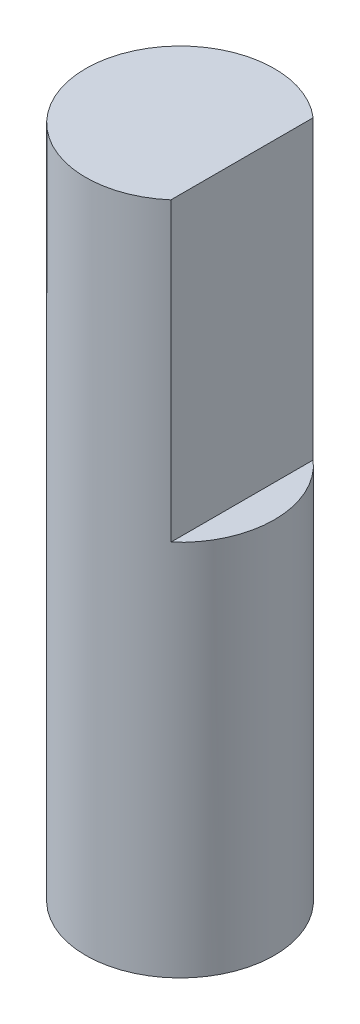
ISO-10303-21;
HEADER;
FILE_DESCRIPTION(('STEP AP214'),'2;1');
FILE_NAME('part.step','',(''),(''),'','','');
FILE_SCHEMA(('AUTOMOTIVE_DESIGN { 1 0 10303 214 1 1 1 1 }'));
ENDSEC;
DATA;
#1=APPLICATION_CONTEXT('core data for automotive mechanical design processes');
#2=APPLICATION_PROTOCOL_DEFINITION('international standard','automotive_design',2000,#1);
#3=PRODUCT_CONTEXT('',#1,'mechanical');
#4=PRODUCT('Part','Part','',(#3));
#5=PRODUCT_RELATED_PRODUCT_CATEGORY('part','',(#4));
#6=PRODUCT_DEFINITION_FORMATION('','',#4);
#7=PRODUCT_DEFINITION_CONTEXT('part definition',#1,'design');
#8=PRODUCT_DEFINITION('design','',#6,#7);
#9=PRODUCT_DEFINITION_SHAPE('','',#8);
#10=(LENGTH_UNIT() NAMED_UNIT(*) SI_UNIT(.MILLI.,.METRE.));
#11=(NAMED_UNIT(*) PLANE_ANGLE_UNIT() SI_UNIT($,.RADIAN.));
#12=(NAMED_UNIT(*) SI_UNIT($,.STERADIAN.) SOLID_ANGLE_UNIT());
#13=UNCERTAINTY_MEASURE_WITH_UNIT(LENGTH_MEASURE(1.E-05),#10,'distance_accuracy_value','');
#14=(GEOMETRIC_REPRESENTATION_CONTEXT(3) GLOBAL_UNCERTAINTY_ASSIGNED_CONTEXT((#13)) GLOBAL_UNIT_ASSIGNED_CONTEXT((#10,
#11,#12)) REPRESENTATION_CONTEXT('',''));
#15=CARTESIAN_POINT('',(0.,0.,0.));
#16=DIRECTION('',(0.,0.,1.));
#17=DIRECTION('',(1.,0.,0.));
#18=AXIS2_PLACEMENT_3D('',#15,#16,#17);
#19=CARTESIAN_POINT('',(0.,25.,0.));
#20=DIRECTION('',(0.,-1.,0.));
#21=DIRECTION('',(0.,0.,-1.));
#22=AXIS2_PLACEMENT_3D('',#19,#20,#21);
#23=CYLINDRICAL_SURFACE('',#22,3.5);
#24=CARTESIAN_POINT('',(0.,25.,0.));
#25=DIRECTION('',(0.,1.,0.));
#26=DIRECTION('',(0.,0.,1.));
#27=AXIS2_PLACEMENT_3D('',#24,#25,#26);
#28=CIRCLE('',#27,3.5);
#29=CARTESIAN_POINT('',(2.3,25.,-2.63818119165458));
#30=VERTEX_POINT('',#29);
#31=CARTESIAN_POINT('',(2.3,25.,2.63818119165458));
#32=VERTEX_POINT('',#31);
#33=EDGE_CURVE('E66',#30,#32,#28,.T.);
#34=ORIENTED_EDGE('',*,*,#33,.F.);
#35=DIRECTION('',(0.,-1.,0.));
#36=VECTOR('',#35,1.);
#37=CARTESIAN_POINT('',(2.3,25.,-2.63818119165458));
#38=LINE('',#37,#36);
#39=CARTESIAN_POINT('',(2.3,14.,-2.63818119165458));
#40=VERTEX_POINT('',#39);
#41=EDGE_CURVE('E50',#30,#40,#38,.T.);
#42=ORIENTED_EDGE('',*,*,#41,.T.);
#43=CARTESIAN_POINT('',(0.,14.,0.));
#44=DIRECTION('',(0.,-1.,0.));
#45=DIRECTION('',(0.,0.,-1.));
#46=AXIS2_PLACEMENT_3D('',#43,#44,#45);
#47=CIRCLE('',#46,3.5);
#48=CARTESIAN_POINT('',(2.3,14.,2.63818119165458));
#49=VERTEX_POINT('',#48);
#50=EDGE_CURVE('E11',#40,#49,#47,.T.);
#51=ORIENTED_EDGE('',*,*,#50,.T.);
#52=DIRECTION('',(0.,-1.,0.));
#53=VECTOR('',#52,1.);
#54=CARTESIAN_POINT('',(2.3,25.,2.63818119165458));
#55=LINE('',#54,#53);
#56=EDGE_CURVE('E62',#49,#32,#55,.F.);
#57=ORIENTED_EDGE('',*,*,#56,.T.);
#58=EDGE_LOOP('',(#34,#42,#51,#57));
#59=FACE_BOUND('',#58,.T.);
#60=CARTESIAN_POINT('',(0.,0.,0.));
#61=DIRECTION('',(0.,1.,0.));
#62=DIRECTION('',(0.,0.,1.));
#63=AXIS2_PLACEMENT_3D('',#60,#61,#62);
#64=CIRCLE('',#63,3.5);
#65=CARTESIAN_POINT('',(0.,0.,3.5));
#66=VERTEX_POINT('',#65);
#67=EDGE_CURVE('E72',#66,#66,#64,.T.);
#68=ORIENTED_EDGE('',*,*,#67,.T.);
#69=EDGE_LOOP('',(#68));
#70=FACE_BOUND('',#69,.T.);
#71=ADVANCED_FACE('F36',(#59,#70),#23,.T.);
#72=CARTESIAN_POINT('',(0.,25.,0.));
#73=DIRECTION('',(0.,1.,0.));
#74=DIRECTION('',(0.,0.,1.));
#75=AXIS2_PLACEMENT_3D('',#72,#73,#74);
#76=PLANE('',#75);
#77=DIRECTION('',(0.,0.,1.));
#78=VECTOR('',#77,1.);
#79=CARTESIAN_POINT('',(2.3,25.,0.));
#80=LINE('',#79,#78);
#81=EDGE_CURVE('E43',#30,#32,#80,.T.);
#82=ORIENTED_EDGE('',*,*,#81,.F.);
#83=ORIENTED_EDGE('',*,*,#33,.T.);
#84=EDGE_LOOP('',(#82,#83));
#85=FACE_BOUND('',#84,.T.);
#86=ADVANCED_FACE('F71',(#85),#76,.T.);
#87=CARTESIAN_POINT('',(0.,0.,0.));
#88=DIRECTION('',(0.,1.,0.));
#89=DIRECTION('',(0.,0.,1.));
#90=AXIS2_PLACEMENT_3D('',#87,#88,#89);
#91=PLANE('',#90);
#92=ORIENTED_EDGE('',*,*,#67,.F.);
#93=EDGE_LOOP('',(#92));
#94=FACE_BOUND('',#93,.T.);
#95=ADVANCED_FACE('F80',(#94),#91,.F.);
#96=CARTESIAN_POINT('',(3.5,14.,3.5));
#97=DIRECTION('',(0.,-1.,0.));
#98=DIRECTION('',(0.,0.,-1.));
#99=AXIS2_PLACEMENT_3D('',#96,#97,#98);
#100=PLANE('',#99);
#101=DIRECTION('',(0.,0.,-1.));
#102=VECTOR('',#101,1.);
#103=CARTESIAN_POINT('',(2.3,14.,3.5));
#104=LINE('',#103,#102);
#105=EDGE_CURVE('E69',#49,#40,#104,.T.);
#106=ORIENTED_EDGE('',*,*,#105,.F.);
#107=ORIENTED_EDGE('',*,*,#50,.F.);
#108=EDGE_LOOP('',(#106,#107));
#109=FACE_BOUND('',#108,.T.);
#110=ADVANCED_FACE('F78',(#109),#100,.F.);
#111=CARTESIAN_POINT('',(2.3,25.,3.5));
#112=DIRECTION('',(-1.,0.,0.));
#113=DIRECTION('',(0.,-1.,0.));
#114=AXIS2_PLACEMENT_3D('',#111,#112,#113);
#115=PLANE('',#114);
#116=ORIENTED_EDGE('',*,*,#81,.T.);
#117=ORIENTED_EDGE('',*,*,#56,.F.);
#118=ORIENTED_EDGE('',*,*,#105,.T.);
#119=ORIENTED_EDGE('',*,*,#41,.F.);
#120=EDGE_LOOP('',(#116,#117,#118,#119));
#121=FACE_BOUND('',#120,.T.);
#122=ADVANCED_FACE('F61',(#121),#115,.F.);
#123=CLOSED_SHELL('',(#71,#86,#95,#110,#122));
#124=MANIFOLD_SOLID_BREP('B2',#123);
#125=ADVANCED_BREP_SHAPE_REPRESENTATION('',(#18,#124),#14);
#126=SHAPE_DEFINITION_REPRESENTATION(#9,#125);
ENDSEC;
END-ISO-10303-21;
